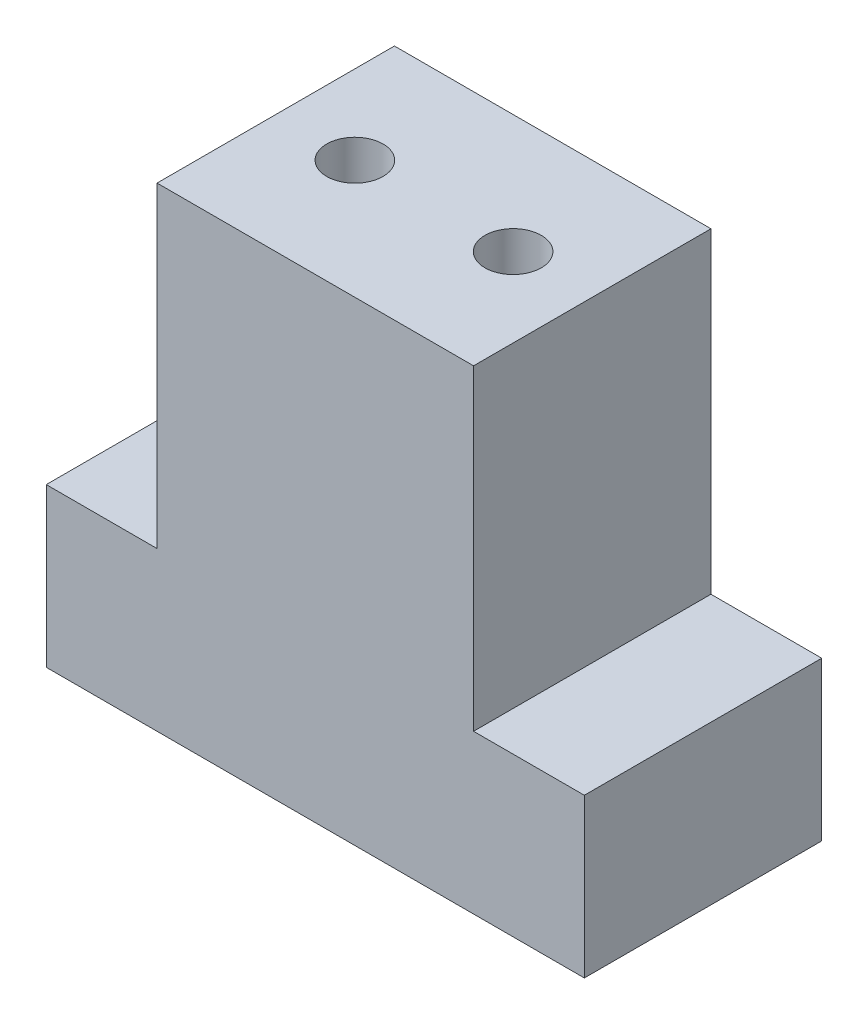
ISO-10303-21;
HEADER;
FILE_DESCRIPTION(('STEP AP214'),'2;1');
FILE_NAME('part.step','',(''),(''),'','','');
FILE_SCHEMA(('AUTOMOTIVE_DESIGN { 1 0 10303 214 1 1 1 1 }'));
ENDSEC;
DATA;
#1=APPLICATION_CONTEXT('core data for automotive mechanical design processes');
#2=APPLICATION_PROTOCOL_DEFINITION('international standard','automotive_design',2000,#1);
#3=PRODUCT_CONTEXT('',#1,'mechanical');
#4=PRODUCT('Part','Part','',(#3));
#5=PRODUCT_RELATED_PRODUCT_CATEGORY('part','',(#4));
#6=PRODUCT_DEFINITION_FORMATION('','',#4);
#7=PRODUCT_DEFINITION_CONTEXT('part definition',#1,'design');
#8=PRODUCT_DEFINITION('design','',#6,#7);
#9=PRODUCT_DEFINITION_SHAPE('','',#8);
#10=(LENGTH_UNIT() NAMED_UNIT(*) SI_UNIT(.MILLI.,.METRE.));
#11=(NAMED_UNIT(*) PLANE_ANGLE_UNIT() SI_UNIT($,.RADIAN.));
#12=(NAMED_UNIT(*) SI_UNIT($,.STERADIAN.) SOLID_ANGLE_UNIT());
#13=UNCERTAINTY_MEASURE_WITH_UNIT(LENGTH_MEASURE(1.E-05),#10,'distance_accuracy_value','');
#14=(GEOMETRIC_REPRESENTATION_CONTEXT(3) GLOBAL_UNCERTAINTY_ASSIGNED_CONTEXT((#13)) GLOBAL_UNIT_ASSIGNED_CONTEXT((#10,
#11,#12)) REPRESENTATION_CONTEXT('',''));
#15=CARTESIAN_POINT('',(0.,0.,0.));
#16=DIRECTION('',(0.,0.,1.));
#17=DIRECTION('',(1.,0.,0.));
#18=AXIS2_PLACEMENT_3D('',#15,#16,#17);
#19=CARTESIAN_POINT('',(6.35,12.7,4.7625));
#20=DIRECTION('',(-1.,0.,0.));
#21=DIRECTION('',(0.,0.,1.));
#22=AXIS2_PLACEMENT_3D('',#19,#20,#21);
#23=PLANE('',#22);
#24=DIRECTION('',(0.,0.,-1.));
#25=VECTOR('',#24,1.);
#26=CARTESIAN_POINT('',(6.35,0.,4.7625));
#27=LINE('',#26,#25);
#28=CARTESIAN_POINT('',(6.35,0.,4.7625));
#29=VERTEX_POINT('',#28);
#30=CARTESIAN_POINT('',(6.35,0.,-4.7625));
#31=VERTEX_POINT('',#30);
#32=EDGE_CURVE('E149',#29,#31,#27,.T.);
#33=ORIENTED_EDGE('',*,*,#32,.T.);
#34=DIRECTION('',(0.,-1.,0.));
#35=VECTOR('',#34,1.);
#36=CARTESIAN_POINT('',(6.35,12.7,-4.7625));
#37=LINE('',#36,#35);
#38=CARTESIAN_POINT('',(6.35,12.7,-4.7625));
#39=VERTEX_POINT('',#38);
#40=EDGE_CURVE('E11',#39,#31,#37,.T.);
#41=ORIENTED_EDGE('',*,*,#40,.F.);
#42=DIRECTION('',(0.,0.,-1.));
#43=VECTOR('',#42,1.);
#44=CARTESIAN_POINT('',(6.35,12.7,4.7625));
#45=LINE('',#44,#43);
#46=CARTESIAN_POINT('',(6.35,12.7,4.7625));
#47=VERTEX_POINT('',#46);
#48=EDGE_CURVE('E157',#47,#39,#45,.T.);
#49=ORIENTED_EDGE('',*,*,#48,.F.);
#50=DIRECTION('',(0.,-1.,0.));
#51=VECTOR('',#50,1.);
#52=CARTESIAN_POINT('',(6.35,12.7,4.7625));
#53=LINE('',#52,#51);
#54=EDGE_CURVE('E169',#47,#29,#53,.T.);
#55=ORIENTED_EDGE('',*,*,#54,.T.);
#56=EDGE_LOOP('',(#33,#41,#49,#55));
#57=FACE_BOUND('',#56,.T.);
#58=ADVANCED_FACE('F43',(#57),#23,.F.);
#59=CARTESIAN_POINT('',(-6.35,12.7,-4.7625));
#60=DIRECTION('',(0.,0.,1.));
#61=DIRECTION('',(1.,0.,0.));
#62=AXIS2_PLACEMENT_3D('',#59,#60,#61);
#63=PLANE('',#62);
#64=ORIENTED_EDGE('',*,*,#40,.T.);
#65=DIRECTION('',(1.,0.,0.));
#66=VECTOR('',#65,1.);
#67=CARTESIAN_POINT('',(-10.795,0.,-4.7625));
#68=LINE('',#67,#66);
#69=CARTESIAN_POINT('',(10.795,0.,-4.7625));
#70=VERTEX_POINT('',#69);
#71=EDGE_CURVE('E197',#31,#70,#68,.T.);
#72=ORIENTED_EDGE('',*,*,#71,.T.);
#73=DIRECTION('',(0.,1.,0.));
#74=VECTOR('',#73,1.);
#75=CARTESIAN_POINT('',(10.795,-6.35,-4.7625));
#76=LINE('',#75,#74);
#77=CARTESIAN_POINT('',(10.795,-6.35,-4.7625));
#78=VERTEX_POINT('',#77);
#79=EDGE_CURVE('E204',#78,#70,#76,.T.);
#80=ORIENTED_EDGE('',*,*,#79,.F.);
#81=DIRECTION('',(1.,0.,0.));
#82=VECTOR('',#81,1.);
#83=CARTESIAN_POINT('',(-10.795,-6.35,-4.7625));
#84=LINE('',#83,#82);
#85=CARTESIAN_POINT('',(-10.795,-6.35,-4.7625));
#86=VERTEX_POINT('',#85);
#87=EDGE_CURVE('E123',#86,#78,#84,.T.);
#88=ORIENTED_EDGE('',*,*,#87,.F.);
#89=DIRECTION('',(0.,1.,0.));
#90=VECTOR('',#89,1.);
#91=CARTESIAN_POINT('',(-10.795,-6.35,-4.7625));
#92=LINE('',#91,#90);
#93=CARTESIAN_POINT('',(-10.795,0.,-4.7625));
#94=VERTEX_POINT('',#93);
#95=EDGE_CURVE('E141',#86,#94,#92,.T.);
#96=ORIENTED_EDGE('',*,*,#95,.T.);
#97=CARTESIAN_POINT('',(-6.35,0.,-4.7625));
#98=VERTEX_POINT('',#97);
#99=EDGE_CURVE('E128',#94,#98,#68,.T.);
#100=ORIENTED_EDGE('',*,*,#99,.T.);
#101=DIRECTION('',(0.,-1.,0.));
#102=VECTOR('',#101,1.);
#103=CARTESIAN_POINT('',(-6.35,12.7,-4.7625));
#104=LINE('',#103,#102);
#105=CARTESIAN_POINT('',(-6.35,12.7,-4.7625));
#106=VERTEX_POINT('',#105);
#107=EDGE_CURVE('E52',#106,#98,#104,.T.);
#108=ORIENTED_EDGE('',*,*,#107,.F.);
#109=DIRECTION('',(-1.,0.,0.));
#110=VECTOR('',#109,1.);
#111=CARTESIAN_POINT('',(-6.35,12.7,-4.7625));
#112=LINE('',#111,#110);
#113=EDGE_CURVE('E160',#39,#106,#112,.T.);
#114=ORIENTED_EDGE('',*,*,#113,.F.);
#115=EDGE_LOOP('',(#64,#72,#80,#88,#96,#100,#108,#114));
#116=FACE_BOUND('',#115,.T.);
#117=ADVANCED_FACE('F190',(#116),#63,.F.);
#118=CARTESIAN_POINT('',(-6.35,12.7,4.7625));
#119=DIRECTION('',(1.,0.,0.));
#120=DIRECTION('',(0.,0.,-1.));
#121=AXIS2_PLACEMENT_3D('',#118,#119,#120);
#122=PLANE('',#121);
#123=DIRECTION('',(0.,0.,1.));
#124=VECTOR('',#123,1.);
#125=CARTESIAN_POINT('',(-6.35,0.,4.7625));
#126=LINE('',#125,#124);
#127=CARTESIAN_POINT('',(-6.35,0.,4.7625));
#128=VERTEX_POINT('',#127);
#129=EDGE_CURVE('E161',#98,#128,#126,.T.);
#130=ORIENTED_EDGE('',*,*,#129,.T.);
#131=DIRECTION('',(0.,-1.,0.));
#132=VECTOR('',#131,1.);
#133=CARTESIAN_POINT('',(-6.35,12.7,4.7625));
#134=LINE('',#133,#132);
#135=CARTESIAN_POINT('',(-6.35,12.7,4.7625));
#136=VERTEX_POINT('',#135);
#137=EDGE_CURVE('E179',#136,#128,#134,.T.);
#138=ORIENTED_EDGE('',*,*,#137,.F.);
#139=DIRECTION('',(0.,0.,1.));
#140=VECTOR('',#139,1.);
#141=CARTESIAN_POINT('',(-6.35,12.7,4.7625));
#142=LINE('',#141,#140);
#143=EDGE_CURVE('E164',#106,#136,#142,.T.);
#144=ORIENTED_EDGE('',*,*,#143,.F.);
#145=ORIENTED_EDGE('',*,*,#107,.T.);
#146=EDGE_LOOP('',(#130,#138,#144,#145));
#147=FACE_BOUND('',#146,.T.);
#148=ADVANCED_FACE('F186',(#147),#122,.F.);
#149=CARTESIAN_POINT('',(-6.35,12.7,4.7625));
#150=DIRECTION('',(0.,0.,-1.));
#151=DIRECTION('',(-1.,0.,0.));
#152=AXIS2_PLACEMENT_3D('',#149,#150,#151);
#153=PLANE('',#152);
#154=ORIENTED_EDGE('',*,*,#137,.T.);
#155=DIRECTION('',(-1.,0.,0.));
#156=VECTOR('',#155,1.);
#157=CARTESIAN_POINT('',(-10.795,0.,4.7625));
#158=LINE('',#157,#156);
#159=CARTESIAN_POINT('',(-10.795,0.,4.7625));
#160=VERTEX_POINT('',#159);
#161=EDGE_CURVE('E213',#128,#160,#158,.T.);
#162=ORIENTED_EDGE('',*,*,#161,.T.);
#163=DIRECTION('',(0.,1.,0.));
#164=VECTOR('',#163,1.);
#165=CARTESIAN_POINT('',(-10.795,-6.35,4.7625));
#166=LINE('',#165,#164);
#167=CARTESIAN_POINT('',(-10.795,-6.35,4.7625));
#168=VERTEX_POINT('',#167);
#169=EDGE_CURVE('E113',#168,#160,#166,.T.);
#170=ORIENTED_EDGE('',*,*,#169,.F.);
#171=DIRECTION('',(-1.,0.,0.));
#172=VECTOR('',#171,1.);
#173=CARTESIAN_POINT('',(-10.795,-6.35,4.7625));
#174=LINE('',#173,#172);
#175=CARTESIAN_POINT('',(10.795,-6.35,4.7625));
#176=VERTEX_POINT('',#175);
#177=EDGE_CURVE('E104',#176,#168,#174,.T.);
#178=ORIENTED_EDGE('',*,*,#177,.F.);
#179=DIRECTION('',(0.,1.,0.));
#180=VECTOR('',#179,1.);
#181=CARTESIAN_POINT('',(10.795,-6.35,4.7625));
#182=LINE('',#181,#180);
#183=CARTESIAN_POINT('',(10.795,0.,4.7625));
#184=VERTEX_POINT('',#183);
#185=EDGE_CURVE('E110',#176,#184,#182,.T.);
#186=ORIENTED_EDGE('',*,*,#185,.T.);
#187=EDGE_CURVE('E215',#184,#29,#158,.T.);
#188=ORIENTED_EDGE('',*,*,#187,.T.);
#189=ORIENTED_EDGE('',*,*,#54,.F.);
#190=DIRECTION('',(1.,0.,0.));
#191=VECTOR('',#190,1.);
#192=CARTESIAN_POINT('',(-6.35,12.7,4.7625));
#193=LINE('',#192,#191);
#194=EDGE_CURVE('E59',#136,#47,#193,.T.);
#195=ORIENTED_EDGE('',*,*,#194,.F.);
#196=EDGE_LOOP('',(#154,#162,#170,#178,#186,#188,#189,#195));
#197=FACE_BOUND('',#196,.T.);
#198=ADVANCED_FACE('F107',(#197),#153,.F.);
#199=CARTESIAN_POINT('',(0.,12.7,0.));
#200=DIRECTION('',(0.,-1.,0.));
#201=DIRECTION('',(0.,0.,-1.));
#202=AXIS2_PLACEMENT_3D('',#199,#200,#201);
#203=PLANE('',#202);
#204=CARTESIAN_POINT('',(3.175,12.7,0.));
#205=DIRECTION('',(0.,1.,0.));
#206=DIRECTION('',(0.,0.,1.));
#207=AXIS2_PLACEMENT_3D('',#204,#205,#206);
#208=CIRCLE('',#207,1.1303);
#209=CARTESIAN_POINT('',(3.175,12.7,1.1303));
#210=VERTEX_POINT('',#209);
#211=EDGE_CURVE('E150',#210,#210,#208,.T.);
#212=ORIENTED_EDGE('',*,*,#211,.F.);
#213=EDGE_LOOP('',(#212));
#214=FACE_BOUND('',#213,.T.);
#215=CARTESIAN_POINT('',(-3.175,12.7,0.));
#216=DIRECTION('',(0.,1.,0.));
#217=DIRECTION('',(0.,0.,1.));
#218=AXIS2_PLACEMENT_3D('',#215,#216,#217);
#219=CIRCLE('',#218,1.1303);
#220=CARTESIAN_POINT('',(-3.175,12.7,1.1303));
#221=VERTEX_POINT('',#220);
#222=EDGE_CURVE('E139',#221,#221,#219,.T.);
#223=ORIENTED_EDGE('',*,*,#222,.F.);
#224=EDGE_LOOP('',(#223));
#225=FACE_BOUND('',#224,.T.);
#226=ORIENTED_EDGE('',*,*,#48,.T.);
#227=ORIENTED_EDGE('',*,*,#113,.T.);
#228=ORIENTED_EDGE('',*,*,#143,.T.);
#229=ORIENTED_EDGE('',*,*,#194,.T.);
#230=EDGE_LOOP('',(#226,#227,#228,#229));
#231=FACE_BOUND('',#230,.T.);
#232=ADVANCED_FACE('F242',(#214,#225,#231),#203,.F.);
#233=CARTESIAN_POINT('',(-3.175,6.35,0.));
#234=DIRECTION('',(0.,1.,0.));
#235=DIRECTION('',(0.,0.,1.));
#236=AXIS2_PLACEMENT_3D('',#233,#234,#235);
#237=CYLINDRICAL_SURFACE('',#236,1.1303);
#238=CARTESIAN_POINT('',(-3.175,6.35,0.));
#239=DIRECTION('',(0.,1.,0.));
#240=DIRECTION('',(0.,0.,1.));
#241=AXIS2_PLACEMENT_3D('',#238,#239,#240);
#242=CIRCLE('',#241,1.1303);
#243=CARTESIAN_POINT('',(-3.175,6.35,1.1303));
#244=VERTEX_POINT('',#243);
#245=EDGE_CURVE('E134',#244,#244,#242,.T.);
#246=ORIENTED_EDGE('',*,*,#245,.F.);
#247=EDGE_LOOP('',(#246));
#248=FACE_BOUND('',#247,.T.);
#249=ORIENTED_EDGE('',*,*,#222,.T.);
#250=EDGE_LOOP('',(#249));
#251=FACE_BOUND('',#250,.T.);
#252=ADVANCED_FACE('F244',(#248,#251),#237,.F.);
#253=CARTESIAN_POINT('',(-3.175,6.35,0.));
#254=DIRECTION('',(0.,1.,0.));
#255=DIRECTION('',(0.,0.,1.));
#256=AXIS2_PLACEMENT_3D('',#253,#254,#255);
#257=PLANE('',#256);
#258=ORIENTED_EDGE('',*,*,#245,.T.);
#259=EDGE_LOOP('',(#258));
#260=FACE_BOUND('',#259,.T.);
#261=ADVANCED_FACE('F251',(#260),#257,.T.);
#262=CARTESIAN_POINT('',(3.175,6.35,0.));
#263=DIRECTION('',(0.,1.,0.));
#264=DIRECTION('',(0.,0.,1.));
#265=AXIS2_PLACEMENT_3D('',#262,#263,#264);
#266=CYLINDRICAL_SURFACE('',#265,1.1303);
#267=CARTESIAN_POINT('',(3.175,6.35,0.));
#268=DIRECTION('',(0.,1.,0.));
#269=DIRECTION('',(0.,0.,1.));
#270=AXIS2_PLACEMENT_3D('',#267,#268,#269);
#271=CIRCLE('',#270,1.1303);
#272=CARTESIAN_POINT('',(3.175,6.35,1.1303));
#273=VERTEX_POINT('',#272);
#274=EDGE_CURVE('E145',#273,#273,#271,.T.);
#275=ORIENTED_EDGE('',*,*,#274,.F.);
#276=EDGE_LOOP('',(#275));
#277=FACE_BOUND('',#276,.T.);
#278=ORIENTED_EDGE('',*,*,#211,.T.);
#279=EDGE_LOOP('',(#278));
#280=FACE_BOUND('',#279,.T.);
#281=ADVANCED_FACE('F368',(#277,#280),#266,.F.);
#282=CARTESIAN_POINT('',(3.175,6.35,0.));
#283=DIRECTION('',(0.,1.,0.));
#284=DIRECTION('',(0.,0.,1.));
#285=AXIS2_PLACEMENT_3D('',#282,#283,#284);
#286=PLANE('',#285);
#287=ORIENTED_EDGE('',*,*,#274,.T.);
#288=EDGE_LOOP('',(#287));
#289=FACE_BOUND('',#288,.T.);
#290=ADVANCED_FACE('F231',(#289),#286,.T.);
#291=CARTESIAN_POINT('',(0.,0.,0.));
#292=DIRECTION('',(0.,1.,0.));
#293=DIRECTION('',(0.,0.,1.));
#294=AXIS2_PLACEMENT_3D('',#291,#292,#293);
#295=PLANE('',#294);
#296=ORIENTED_EDGE('',*,*,#32,.F.);
#297=ORIENTED_EDGE('',*,*,#187,.F.);
#298=DIRECTION('',(0.,0.,1.));
#299=VECTOR('',#298,1.);
#300=CARTESIAN_POINT('',(10.795,0.,-4.7625));
#301=LINE('',#300,#299);
#302=EDGE_CURVE('E132',#70,#184,#301,.T.);
#303=ORIENTED_EDGE('',*,*,#302,.F.);
#304=ORIENTED_EDGE('',*,*,#71,.F.);
#305=EDGE_LOOP('',(#296,#297,#303,#304));
#306=FACE_BOUND('',#305,.T.);
#307=ADVANCED_FACE('F224',(#306),#295,.T.);
#308=ORIENTED_EDGE('',*,*,#129,.F.);
#309=ORIENTED_EDGE('',*,*,#99,.F.);
#310=DIRECTION('',(0.,0.,-1.));
#311=VECTOR('',#310,1.);
#312=CARTESIAN_POINT('',(-10.795,0.,-4.7625));
#313=LINE('',#312,#311);
#314=EDGE_CURVE('E200',#160,#94,#313,.T.);
#315=ORIENTED_EDGE('',*,*,#314,.F.);
#316=ORIENTED_EDGE('',*,*,#161,.F.);
#317=EDGE_LOOP('',(#308,#309,#315,#316));
#318=FACE_BOUND('',#317,.T.);
#319=ADVANCED_FACE('F222',(#318),#295,.T.);
#320=CARTESIAN_POINT('',(10.795,-6.35,-4.7625));
#321=DIRECTION('',(-1.,0.,0.));
#322=DIRECTION('',(0.,0.,1.));
#323=AXIS2_PLACEMENT_3D('',#320,#321,#322);
#324=PLANE('',#323);
#325=ORIENTED_EDGE('',*,*,#302,.T.);
#326=ORIENTED_EDGE('',*,*,#185,.F.);
#327=DIRECTION('',(0.,0.,1.));
#328=VECTOR('',#327,1.);
#329=CARTESIAN_POINT('',(10.795,-6.35,-4.7625));
#330=LINE('',#329,#328);
#331=EDGE_CURVE('E118',#78,#176,#330,.T.);
#332=ORIENTED_EDGE('',*,*,#331,.F.);
#333=ORIENTED_EDGE('',*,*,#79,.T.);
#334=EDGE_LOOP('',(#325,#326,#332,#333));
#335=FACE_BOUND('',#334,.T.);
#336=ADVANCED_FACE('F130',(#335),#324,.F.);
#337=CARTESIAN_POINT('',(-10.795,-6.35,-4.7625));
#338=DIRECTION('',(1.,0.,0.));
#339=DIRECTION('',(0.,0.,-1.));
#340=AXIS2_PLACEMENT_3D('',#337,#338,#339);
#341=PLANE('',#340);
#342=ORIENTED_EDGE('',*,*,#314,.T.);
#343=ORIENTED_EDGE('',*,*,#95,.F.);
#344=DIRECTION('',(0.,0.,-1.));
#345=VECTOR('',#344,1.);
#346=CARTESIAN_POINT('',(-10.795,-6.35,-4.7625));
#347=LINE('',#346,#345);
#348=EDGE_CURVE('E117',#168,#86,#347,.T.);
#349=ORIENTED_EDGE('',*,*,#348,.F.);
#350=ORIENTED_EDGE('',*,*,#169,.T.);
#351=EDGE_LOOP('',(#342,#343,#349,#350));
#352=FACE_BOUND('',#351,.T.);
#353=ADVANCED_FACE('F221',(#352),#341,.F.);
#354=CARTESIAN_POINT('',(0.,-6.35,0.));
#355=DIRECTION('',(0.,1.,0.));
#356=DIRECTION('',(0.,0.,1.));
#357=AXIS2_PLACEMENT_3D('',#354,#355,#356);
#358=PLANE('',#357);
#359=CARTESIAN_POINT('',(-4.7625,-6.35,0.));
#360=DIRECTION('',(0.,-1.,0.));
#361=DIRECTION('',(0.,0.,-1.));
#362=AXIS2_PLACEMENT_3D('',#359,#360,#361);
#363=CIRCLE('',#362,1.1303);
#364=CARTESIAN_POINT('',(-4.7625,-6.35,-1.1303));
#365=VERTEX_POINT('',#364);
#366=EDGE_CURVE('E440',#365,#365,#363,.T.);
#367=ORIENTED_EDGE('',*,*,#366,.F.);
#368=EDGE_LOOP('',(#367));
#369=FACE_BOUND('',#368,.T.);
#370=CARTESIAN_POINT('',(4.7625,-6.35,0.));
#371=DIRECTION('',(0.,-1.,0.));
#372=DIRECTION('',(0.,0.,-1.));
#373=AXIS2_PLACEMENT_3D('',#370,#371,#372);
#374=CIRCLE('',#373,1.1303);
#375=CARTESIAN_POINT('',(4.7625,-6.35,-1.1303));
#376=VERTEX_POINT('',#375);
#377=EDGE_CURVE('E444',#376,#376,#374,.T.);
#378=ORIENTED_EDGE('',*,*,#377,.F.);
#379=EDGE_LOOP('',(#378));
#380=FACE_BOUND('',#379,.T.);
#381=ORIENTED_EDGE('',*,*,#331,.T.);
#382=ORIENTED_EDGE('',*,*,#177,.T.);
#383=ORIENTED_EDGE('',*,*,#348,.T.);
#384=ORIENTED_EDGE('',*,*,#87,.T.);
#385=EDGE_LOOP('',(#381,#382,#383,#384));
#386=FACE_BOUND('',#385,.T.);
#387=ADVANCED_FACE('F121',(#369,#380,#386),#358,.F.);
#388=CARTESIAN_POINT('',(4.7625,0.,0.));
#389=DIRECTION('',(0.,-1.,0.));
#390=DIRECTION('',(0.,0.,-1.));
#391=AXIS2_PLACEMENT_3D('',#388,#389,#390);
#392=CYLINDRICAL_SURFACE('',#391,1.1303);
#393=CARTESIAN_POINT('',(4.7625,0.,0.));
#394=DIRECTION('',(0.,-1.,0.));
#395=DIRECTION('',(0.,0.,-1.));
#396=AXIS2_PLACEMENT_3D('',#393,#394,#395);
#397=CIRCLE('',#396,1.1303);
#398=CARTESIAN_POINT('',(4.7625,0.,-1.1303));
#399=VERTEX_POINT('',#398);
#400=EDGE_CURVE('E450',#399,#399,#397,.T.);
#401=ORIENTED_EDGE('',*,*,#400,.F.);
#402=EDGE_LOOP('',(#401));
#403=FACE_BOUND('',#402,.T.);
#404=ORIENTED_EDGE('',*,*,#377,.T.);
#405=EDGE_LOOP('',(#404));
#406=FACE_BOUND('',#405,.T.);
#407=ADVANCED_FACE('F307',(#403,#406),#392,.F.);
#408=CARTESIAN_POINT('',(4.7625,0.,0.));
#409=DIRECTION('',(0.,-1.,0.));
#410=DIRECTION('',(0.,0.,-1.));
#411=AXIS2_PLACEMENT_3D('',#408,#409,#410);
#412=PLANE('',#411);
#413=ORIENTED_EDGE('',*,*,#400,.T.);
#414=EDGE_LOOP('',(#413));
#415=FACE_BOUND('',#414,.T.);
#416=ADVANCED_FACE('F317',(#415),#412,.T.);
#417=CARTESIAN_POINT('',(-4.7625,0.,0.));
#418=DIRECTION('',(0.,-1.,0.));
#419=DIRECTION('',(0.,0.,-1.));
#420=AXIS2_PLACEMENT_3D('',#417,#418,#419);
#421=CYLINDRICAL_SURFACE('',#420,1.1303);
#422=CARTESIAN_POINT('',(-4.7625,0.,0.));
#423=DIRECTION('',(0.,-1.,0.));
#424=DIRECTION('',(0.,0.,-1.));
#425=AXIS2_PLACEMENT_3D('',#422,#423,#424);
#426=CIRCLE('',#425,1.1303);
#427=CARTESIAN_POINT('',(-4.7625,0.,-1.1303));
#428=VERTEX_POINT('',#427);
#429=EDGE_CURVE('E214',#428,#428,#426,.T.);
#430=ORIENTED_EDGE('',*,*,#429,.F.);
#431=EDGE_LOOP('',(#430));
#432=FACE_BOUND('',#431,.T.);
#433=ORIENTED_EDGE('',*,*,#366,.T.);
#434=EDGE_LOOP('',(#433));
#435=FACE_BOUND('',#434,.T.);
#436=ADVANCED_FACE('F328',(#432,#435),#421,.F.);
#437=CARTESIAN_POINT('',(-4.7625,0.,0.));
#438=DIRECTION('',(0.,-1.,0.));
#439=DIRECTION('',(0.,0.,-1.));
#440=AXIS2_PLACEMENT_3D('',#437,#438,#439);
#441=PLANE('',#440);
#442=ORIENTED_EDGE('',*,*,#429,.T.);
#443=EDGE_LOOP('',(#442));
#444=FACE_BOUND('',#443,.T.);
#445=ADVANCED_FACE('F339',(#444),#441,.T.);
#446=CLOSED_SHELL('',(#58,#117,#148,#198,#232,#252,#261,#281,#290,#307,#319,#336,#353,#387,#407,
#416,#436,#445));
#447=MANIFOLD_SOLID_BREP('B2',#446);
#448=ADVANCED_BREP_SHAPE_REPRESENTATION('',(#18,#447),#14);
#449=SHAPE_DEFINITION_REPRESENTATION(#9,#448);
ENDSEC;
END-ISO-10303-21;
